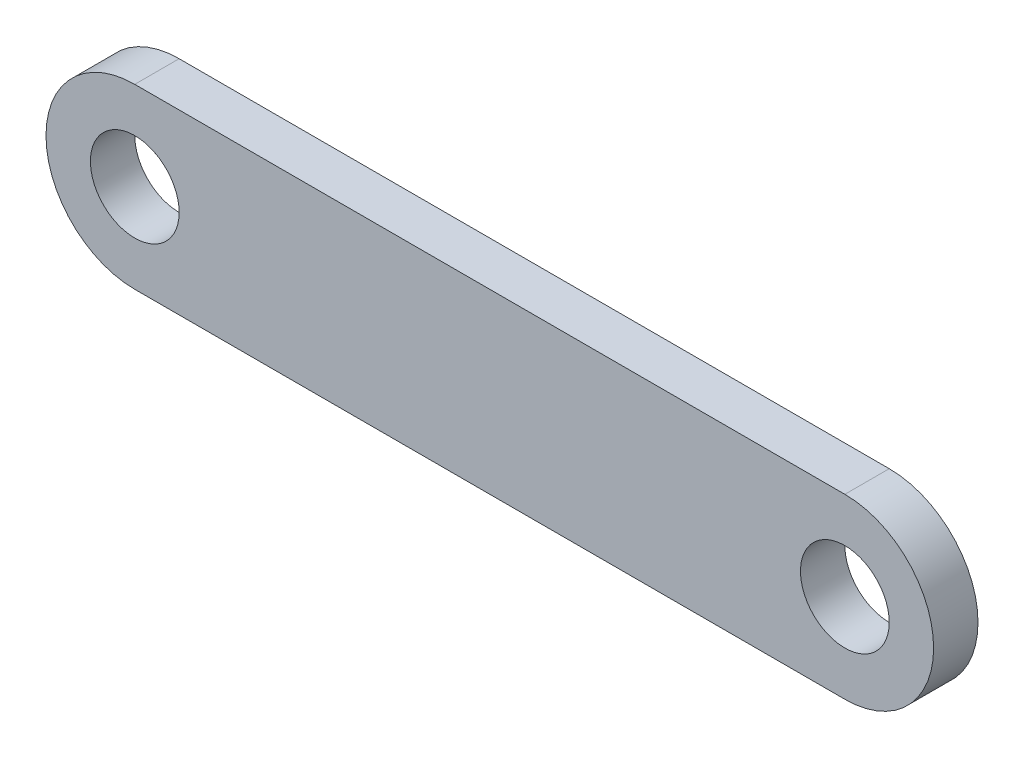
ISO-10303-21;
HEADER;
FILE_DESCRIPTION(('STEP AP214'),'2;1');
FILE_NAME('part.step','',(''),(''),'','','');
FILE_SCHEMA(('AUTOMOTIVE_DESIGN { 1 0 10303 214 1 1 1 1 }'));
ENDSEC;
DATA;
#1=APPLICATION_CONTEXT('core data for automotive mechanical design processes');
#2=APPLICATION_PROTOCOL_DEFINITION('international standard','automotive_design',2000,#1);
#3=PRODUCT_CONTEXT('',#1,'mechanical');
#4=PRODUCT('Part','Part','',(#3));
#5=PRODUCT_RELATED_PRODUCT_CATEGORY('part','',(#4));
#6=PRODUCT_DEFINITION_FORMATION('','',#4);
#7=PRODUCT_DEFINITION_CONTEXT('part definition',#1,'design');
#8=PRODUCT_DEFINITION('design','',#6,#7);
#9=PRODUCT_DEFINITION_SHAPE('','',#8);
#10=(LENGTH_UNIT() NAMED_UNIT(*) SI_UNIT(.MILLI.,.METRE.));
#11=(NAMED_UNIT(*) PLANE_ANGLE_UNIT() SI_UNIT($,.RADIAN.));
#12=(NAMED_UNIT(*) SI_UNIT($,.STERADIAN.) SOLID_ANGLE_UNIT());
#13=UNCERTAINTY_MEASURE_WITH_UNIT(LENGTH_MEASURE(1.E-05),#10,'distance_accuracy_value','');
#14=(GEOMETRIC_REPRESENTATION_CONTEXT(3) GLOBAL_UNCERTAINTY_ASSIGNED_CONTEXT((#13)) GLOBAL_UNIT_ASSIGNED_CONTEXT((#10,
#11,#12)) REPRESENTATION_CONTEXT('',''));
#15=CARTESIAN_POINT('',(0.,0.,0.));
#16=DIRECTION('',(0.,0.,1.));
#17=DIRECTION('',(1.,0.,0.));
#18=AXIS2_PLACEMENT_3D('',#15,#16,#17);
#19=CARTESIAN_POINT('',(0.,0.,1.));
#20=DIRECTION('',(0.,0.,1.));
#21=DIRECTION('',(1.,0.,0.));
#22=AXIS2_PLACEMENT_3D('',#19,#20,#21);
#23=PLANE('',#22);
#24=CARTESIAN_POINT('',(0.,0.,1.));
#25=DIRECTION('',(0.,0.,1.));
#26=DIRECTION('',(1.,0.,0.));
#27=AXIS2_PLACEMENT_3D('',#24,#25,#26);
#28=CIRCLE('',#27,2.);
#29=CARTESIAN_POINT('',(2.,0.,1.));
#30=VERTEX_POINT('',#29);
#31=EDGE_CURVE('E101',#30,#30,#28,.T.);
#32=ORIENTED_EDGE('',*,*,#31,.F.);
#33=EDGE_LOOP('',(#32));
#34=FACE_BOUND('',#33,.T.);
#35=CARTESIAN_POINT('',(0.,0.,1.));
#36=DIRECTION('',(0.,0.,1.));
#37=DIRECTION('',(1.,0.,0.));
#38=AXIS2_PLACEMENT_3D('',#35,#36,#37);
#39=CIRCLE('',#38,4.);
#40=CARTESIAN_POINT('',(0.,4.,1.));
#41=VERTEX_POINT('',#40);
#42=CARTESIAN_POINT('',(0.,-4.,1.));
#43=VERTEX_POINT('',#42);
#44=EDGE_CURVE('E86',#41,#43,#39,.T.);
#45=ORIENTED_EDGE('',*,*,#44,.T.);
#46=DIRECTION('',(1.,0.,0.));
#47=VECTOR('',#46,1.);
#48=CARTESIAN_POINT('',(0.,-4.,1.));
#49=LINE('',#48,#47);
#50=CARTESIAN_POINT('',(32.,-4.,1.));
#51=VERTEX_POINT('',#50);
#52=EDGE_CURVE('E81',#43,#51,#49,.T.);
#53=ORIENTED_EDGE('',*,*,#52,.T.);
#54=CARTESIAN_POINT('',(32.,0.,1.));
#55=DIRECTION('',(0.,0.,1.));
#56=DIRECTION('',(1.,0.,0.));
#57=AXIS2_PLACEMENT_3D('',#54,#55,#56);
#58=CIRCLE('',#57,4.);
#59=CARTESIAN_POINT('',(32.,4.,1.));
#60=VERTEX_POINT('',#59);
#61=EDGE_CURVE('E84',#51,#60,#58,.T.);
#62=ORIENTED_EDGE('',*,*,#61,.T.);
#63=DIRECTION('',(-1.,0.,0.));
#64=VECTOR('',#63,1.);
#65=CARTESIAN_POINT('',(0.,4.,1.));
#66=LINE('',#65,#64);
#67=EDGE_CURVE('E51',#60,#41,#66,.T.);
#68=ORIENTED_EDGE('',*,*,#67,.T.);
#69=EDGE_LOOP('',(#45,#53,#62,#68));
#70=FACE_BOUND('',#69,.T.);
#71=CARTESIAN_POINT('',(32.,0.,1.));
#72=DIRECTION('',(0.,0.,1.));
#73=DIRECTION('',(1.,0.,0.));
#74=AXIS2_PLACEMENT_3D('',#71,#72,#73);
#75=CIRCLE('',#74,2.);
#76=CARTESIAN_POINT('',(34.,0.,1.));
#77=VERTEX_POINT('',#76);
#78=EDGE_CURVE('E116',#77,#77,#75,.T.);
#79=ORIENTED_EDGE('',*,*,#78,.F.);
#80=EDGE_LOOP('',(#79));
#81=FACE_BOUND('',#80,.T.);
#82=ADVANCED_FACE('F34',(#34,#70,#81),#23,.T.);
#83=CARTESIAN_POINT('',(0.,0.,-1.));
#84=DIRECTION('',(0.,0.,1.));
#85=DIRECTION('',(1.,0.,0.));
#86=AXIS2_PLACEMENT_3D('',#83,#84,#85);
#87=PLANE('',#86);
#88=CARTESIAN_POINT('',(0.,0.,-1.));
#89=DIRECTION('',(0.,0.,1.));
#90=DIRECTION('',(1.,0.,0.));
#91=AXIS2_PLACEMENT_3D('',#88,#89,#90);
#92=CIRCLE('',#91,4.);
#93=CARTESIAN_POINT('',(0.,4.,-1.));
#94=VERTEX_POINT('',#93);
#95=CARTESIAN_POINT('',(0.,-4.,-1.));
#96=VERTEX_POINT('',#95);
#97=EDGE_CURVE('E98',#94,#96,#92,.T.);
#98=ORIENTED_EDGE('',*,*,#97,.F.);
#99=DIRECTION('',(-1.,0.,0.));
#100=VECTOR('',#99,1.);
#101=CARTESIAN_POINT('',(0.,4.,-1.));
#102=LINE('',#101,#100);
#103=CARTESIAN_POINT('',(32.,4.,-1.));
#104=VERTEX_POINT('',#103);
#105=EDGE_CURVE('E74',#104,#94,#102,.T.);
#106=ORIENTED_EDGE('',*,*,#105,.F.);
#107=CARTESIAN_POINT('',(32.,0.,-1.));
#108=DIRECTION('',(0.,0.,1.));
#109=DIRECTION('',(1.,0.,0.));
#110=AXIS2_PLACEMENT_3D('',#107,#108,#109);
#111=CIRCLE('',#110,4.);
#112=CARTESIAN_POINT('',(32.,-4.,-1.));
#113=VERTEX_POINT('',#112);
#114=EDGE_CURVE('E68',#113,#104,#111,.T.);
#115=ORIENTED_EDGE('',*,*,#114,.F.);
#116=DIRECTION('',(1.,0.,0.));
#117=VECTOR('',#116,1.);
#118=CARTESIAN_POINT('',(0.,-4.,-1.));
#119=LINE('',#118,#117);
#120=EDGE_CURVE('E90',#96,#113,#119,.T.);
#121=ORIENTED_EDGE('',*,*,#120,.F.);
#122=EDGE_LOOP('',(#98,#106,#115,#121));
#123=FACE_BOUND('',#122,.T.);
#124=CARTESIAN_POINT('',(0.,0.,-1.));
#125=DIRECTION('',(0.,0.,1.));
#126=DIRECTION('',(1.,0.,0.));
#127=AXIS2_PLACEMENT_3D('',#124,#125,#126);
#128=CIRCLE('',#127,2.);
#129=CARTESIAN_POINT('',(2.,0.,-1.));
#130=VERTEX_POINT('',#129);
#131=EDGE_CURVE('E113',#130,#130,#128,.T.);
#132=ORIENTED_EDGE('',*,*,#131,.T.);
#133=EDGE_LOOP('',(#132));
#134=FACE_BOUND('',#133,.T.);
#135=CARTESIAN_POINT('',(32.,0.,-1.));
#136=DIRECTION('',(0.,0.,1.));
#137=DIRECTION('',(1.,0.,0.));
#138=AXIS2_PLACEMENT_3D('',#135,#136,#137);
#139=CIRCLE('',#138,2.);
#140=CARTESIAN_POINT('',(34.,0.,-1.));
#141=VERTEX_POINT('',#140);
#142=EDGE_CURVE('E119',#141,#141,#139,.T.);
#143=ORIENTED_EDGE('',*,*,#142,.T.);
#144=EDGE_LOOP('',(#143));
#145=FACE_BOUND('',#144,.T.);
#146=ADVANCED_FACE('F109',(#123,#134,#145),#87,.F.);
#147=CARTESIAN_POINT('',(0.,0.,1.));
#148=DIRECTION('',(0.,0.,-1.));
#149=DIRECTION('',(-1.,0.,0.));
#150=AXIS2_PLACEMENT_3D('',#147,#148,#149);
#151=CYLINDRICAL_SURFACE('',#150,4.);
#152=ORIENTED_EDGE('',*,*,#97,.T.);
#153=DIRECTION('',(0.,0.,-1.));
#154=VECTOR('',#153,1.);
#155=CARTESIAN_POINT('',(0.,-4.,1.));
#156=LINE('',#155,#154);
#157=EDGE_CURVE('E11',#43,#96,#156,.T.);
#158=ORIENTED_EDGE('',*,*,#157,.F.);
#159=ORIENTED_EDGE('',*,*,#44,.F.);
#160=DIRECTION('',(0.,0.,-1.));
#161=VECTOR('',#160,1.);
#162=CARTESIAN_POINT('',(0.,4.,1.));
#163=LINE('',#162,#161);
#164=EDGE_CURVE('E94',#41,#94,#163,.T.);
#165=ORIENTED_EDGE('',*,*,#164,.T.);
#166=EDGE_LOOP('',(#152,#158,#159,#165));
#167=FACE_BOUND('',#166,.T.);
#168=ADVANCED_FACE('F36',(#167),#151,.T.);
#169=CARTESIAN_POINT('',(0.,-4.,1.));
#170=DIRECTION('',(0.,1.,0.));
#171=DIRECTION('',(0.,0.,1.));
#172=AXIS2_PLACEMENT_3D('',#169,#170,#171);
#173=PLANE('',#172);
#174=ORIENTED_EDGE('',*,*,#120,.T.);
#175=DIRECTION('',(0.,0.,-1.));
#176=VECTOR('',#175,1.);
#177=CARTESIAN_POINT('',(32.,-4.,1.));
#178=LINE('',#177,#176);
#179=EDGE_CURVE('E43',#51,#113,#178,.T.);
#180=ORIENTED_EDGE('',*,*,#179,.F.);
#181=ORIENTED_EDGE('',*,*,#52,.F.);
#182=ORIENTED_EDGE('',*,*,#157,.T.);
#183=EDGE_LOOP('',(#174,#180,#181,#182));
#184=FACE_BOUND('',#183,.T.);
#185=ADVANCED_FACE('F89',(#184),#173,.F.);
#186=CARTESIAN_POINT('',(32.,0.,1.));
#187=DIRECTION('',(0.,0.,-1.));
#188=DIRECTION('',(-1.,0.,0.));
#189=AXIS2_PLACEMENT_3D('',#186,#187,#188);
#190=CYLINDRICAL_SURFACE('',#189,4.);
#191=ORIENTED_EDGE('',*,*,#114,.T.);
#192=DIRECTION('',(0.,0.,-1.));
#193=VECTOR('',#192,1.);
#194=CARTESIAN_POINT('',(32.,4.,1.));
#195=LINE('',#194,#193);
#196=EDGE_CURVE('E91',#60,#104,#195,.T.);
#197=ORIENTED_EDGE('',*,*,#196,.F.);
#198=ORIENTED_EDGE('',*,*,#61,.F.);
#199=ORIENTED_EDGE('',*,*,#179,.T.);
#200=EDGE_LOOP('',(#191,#197,#198,#199));
#201=FACE_BOUND('',#200,.T.);
#202=ADVANCED_FACE('F92',(#201),#190,.T.);
#203=CARTESIAN_POINT('',(0.,4.,1.));
#204=DIRECTION('',(0.,-1.,0.));
#205=DIRECTION('',(0.,0.,-1.));
#206=AXIS2_PLACEMENT_3D('',#203,#204,#205);
#207=PLANE('',#206);
#208=ORIENTED_EDGE('',*,*,#105,.T.);
#209=ORIENTED_EDGE('',*,*,#164,.F.);
#210=ORIENTED_EDGE('',*,*,#67,.F.);
#211=ORIENTED_EDGE('',*,*,#196,.T.);
#212=EDGE_LOOP('',(#208,#209,#210,#211));
#213=FACE_BOUND('',#212,.T.);
#214=ADVANCED_FACE('F106',(#213),#207,.F.);
#215=CARTESIAN_POINT('',(0.,0.,1.));
#216=DIRECTION('',(0.,0.,-1.));
#217=DIRECTION('',(-1.,0.,0.));
#218=AXIS2_PLACEMENT_3D('',#215,#216,#217);
#219=CYLINDRICAL_SURFACE('',#218,2.);
#220=ORIENTED_EDGE('',*,*,#31,.T.);
#221=EDGE_LOOP('',(#220));
#222=FACE_BOUND('',#221,.T.);
#223=ORIENTED_EDGE('',*,*,#131,.F.);
#224=EDGE_LOOP('',(#223));
#225=FACE_BOUND('',#224,.T.);
#226=ADVANCED_FACE('F136',(#222,#225),#219,.F.);
#227=CARTESIAN_POINT('',(32.,0.,1.));
#228=DIRECTION('',(0.,0.,-1.));
#229=DIRECTION('',(-1.,0.,0.));
#230=AXIS2_PLACEMENT_3D('',#227,#228,#229);
#231=CYLINDRICAL_SURFACE('',#230,2.);
#232=ORIENTED_EDGE('',*,*,#78,.T.);
#233=EDGE_LOOP('',(#232));
#234=FACE_BOUND('',#233,.T.);
#235=ORIENTED_EDGE('',*,*,#142,.F.);
#236=EDGE_LOOP('',(#235));
#237=FACE_BOUND('',#236,.T.);
#238=ADVANCED_FACE('F125',(#234,#237),#231,.F.);
#239=CLOSED_SHELL('',(#82,#146,#168,#185,#202,#214,#226,#238));
#240=MANIFOLD_SOLID_BREP('B2',#239);
#241=ADVANCED_BREP_SHAPE_REPRESENTATION('',(#18,#240),#14);
#242=SHAPE_DEFINITION_REPRESENTATION(#9,#241);
ENDSEC;
END-ISO-10303-21;
